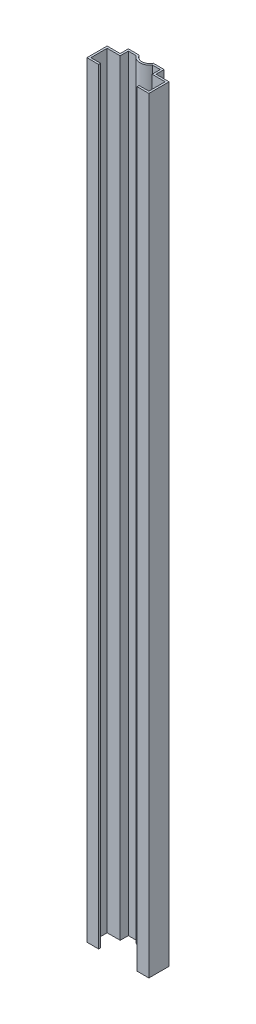
ISO-10303-21;
HEADER;
FILE_DESCRIPTION(('STEP AP214'),'2;1');
FILE_NAME('part.step','',(''),(''),'','','');
FILE_SCHEMA(('AUTOMOTIVE_DESIGN { 1 0 10303 214 1 1 1 1 }'));
ENDSEC;
DATA;
#1=APPLICATION_CONTEXT('core data for automotive mechanical design processes');
#2=APPLICATION_PROTOCOL_DEFINITION('international standard','automotive_design',2000,#1);
#3=PRODUCT_CONTEXT('',#1,'mechanical');
#4=PRODUCT('Part','Part','',(#3));
#5=PRODUCT_RELATED_PRODUCT_CATEGORY('part','',(#4));
#6=PRODUCT_DEFINITION_FORMATION('','',#4);
#7=PRODUCT_DEFINITION_CONTEXT('part definition',#1,'design');
#8=PRODUCT_DEFINITION('design','',#6,#7);
#9=PRODUCT_DEFINITION_SHAPE('','',#8);
#10=(LENGTH_UNIT() NAMED_UNIT(*) SI_UNIT(.MILLI.,.METRE.));
#11=(NAMED_UNIT(*) PLANE_ANGLE_UNIT() SI_UNIT($,.RADIAN.));
#12=(NAMED_UNIT(*) SI_UNIT($,.STERADIAN.) SOLID_ANGLE_UNIT());
#13=UNCERTAINTY_MEASURE_WITH_UNIT(LENGTH_MEASURE(1.E-05),#10,'distance_accuracy_value','');
#14=(GEOMETRIC_REPRESENTATION_CONTEXT(3) GLOBAL_UNCERTAINTY_ASSIGNED_CONTEXT((#13)) GLOBAL_UNIT_ASSIGNED_CONTEXT((#10,
#11,#12)) REPRESENTATION_CONTEXT('',''));
#15=CARTESIAN_POINT('',(0.,0.,0.));
#16=DIRECTION('',(0.,0.,1.));
#17=DIRECTION('',(1.,0.,0.));
#18=AXIS2_PLACEMENT_3D('',#15,#16,#17);
#19=CARTESIAN_POINT('',(0.,4.44089209850063E-13,-91.583123951777));
#20=DIRECTION('',(0.,1.,0.));
#21=DIRECTION('',(0.,0.,1.));
#22=AXIS2_PLACEMENT_3D('',#19,#20,#21);
#23=CYLINDRICAL_SURFACE('',#22,30.);
#24=CARTESIAN_POINT('',(0.,2350.,-91.583123951777));
#25=DIRECTION('',(0.,1.,0.));
#26=DIRECTION('',(0.,0.,1.));
#27=AXIS2_PLACEMENT_3D('',#24,#25,#26);
#28=CIRCLE('',#27,30.);
#29=CARTESIAN_POINT('',(-25.,2350.,-75.));
#30=VERTEX_POINT('',#29);
#31=CARTESIAN_POINT('',(25.,2350.,-75.));
#32=VERTEX_POINT('',#31);
#33=EDGE_CURVE('E225',#30,#32,#28,.T.);
#34=ORIENTED_EDGE('',*,*,#33,.F.);
#35=DIRECTION('',(0.,1.,0.));
#36=VECTOR('',#35,1.);
#37=CARTESIAN_POINT('',(-25.,4.44089209850063E-13,-75.));
#38=LINE('',#37,#36);
#39=CARTESIAN_POINT('',(-25.,4.44089209850063E-13,-75.));
#40=VERTEX_POINT('',#39);
#41=EDGE_CURVE('E11',#40,#30,#38,.T.);
#42=ORIENTED_EDGE('',*,*,#41,.F.);
#43=CARTESIAN_POINT('',(0.,4.44089209850063E-13,-91.583123951777));
#44=DIRECTION('',(0.,1.,0.));
#45=DIRECTION('',(0.,0.,1.));
#46=AXIS2_PLACEMENT_3D('',#43,#44,#45);
#47=CIRCLE('',#46,30.);
#48=CARTESIAN_POINT('',(25.,4.44089209850063E-13,-75.));
#49=VERTEX_POINT('',#48);
#50=EDGE_CURVE('E293',#40,#49,#47,.T.);
#51=ORIENTED_EDGE('',*,*,#50,.T.);
#52=DIRECTION('',(0.,1.,0.));
#53=VECTOR('',#52,1.);
#54=CARTESIAN_POINT('',(25.,4.44089209850063E-13,-75.));
#55=LINE('',#54,#53);
#56=EDGE_CURVE('E35',#49,#32,#55,.T.);
#57=ORIENTED_EDGE('',*,*,#56,.T.);
#58=EDGE_LOOP('',(#34,#42,#51,#57));
#59=FACE_BOUND('',#58,.T.);
#60=ADVANCED_FACE('F32',(#59),#23,.T.);
#61=CARTESIAN_POINT('',(-49.,4.44089209850063E-13,-75.));
#62=DIRECTION('',(0.,0.,1.));
#63=DIRECTION('',(1.,0.,0.));
#64=AXIS2_PLACEMENT_3D('',#61,#62,#63);
#65=PLANE('',#64);
#66=DIRECTION('',(1.,0.,0.));
#67=VECTOR('',#66,1.);
#68=CARTESIAN_POINT('',(-49.,2350.,-75.));
#69=LINE('',#68,#67);
#70=CARTESIAN_POINT('',(-49.,2350.,-75.));
#71=VERTEX_POINT('',#70);
#72=EDGE_CURVE('E291',#71,#30,#69,.T.);
#73=ORIENTED_EDGE('',*,*,#72,.F.);
#74=DIRECTION('',(0.,1.,0.));
#75=VECTOR('',#74,1.);
#76=CARTESIAN_POINT('',(-49.,4.44089209850063E-13,-75.));
#77=LINE('',#76,#75);
#78=CARTESIAN_POINT('',(-49.,4.44089209850063E-13,-75.));
#79=VERTEX_POINT('',#78);
#80=EDGE_CURVE('E41',#79,#71,#77,.T.);
#81=ORIENTED_EDGE('',*,*,#80,.F.);
#82=DIRECTION('',(1.,0.,0.));
#83=VECTOR('',#82,1.);
#84=CARTESIAN_POINT('',(-49.,4.44089209850063E-13,-75.));
#85=LINE('',#84,#83);
#86=EDGE_CURVE('E215',#79,#40,#85,.T.);
#87=ORIENTED_EDGE('',*,*,#86,.T.);
#88=ORIENTED_EDGE('',*,*,#41,.T.);
#89=EDGE_LOOP('',(#73,#81,#87,#88));
#90=FACE_BOUND('',#89,.T.);
#91=ADVANCED_FACE('F337',(#90),#65,.T.);
#92=CARTESIAN_POINT('',(-49.,4.44089209850063E-13,-50.));
#93=DIRECTION('',(1.,0.,0.));
#94=DIRECTION('',(0.,0.,-1.));
#95=AXIS2_PLACEMENT_3D('',#92,#93,#94);
#96=PLANE('',#95);
#97=DIRECTION('',(0.,0.,-1.));
#98=VECTOR('',#97,1.);
#99=CARTESIAN_POINT('',(-49.,2350.,-50.));
#100=LINE('',#99,#98);
#101=CARTESIAN_POINT('',(-49.,2350.,-50.));
#102=VERTEX_POINT('',#101);
#103=EDGE_CURVE('E202',#102,#71,#100,.T.);
#104=ORIENTED_EDGE('',*,*,#103,.F.);
#105=DIRECTION('',(0.,1.,0.));
#106=VECTOR('',#105,1.);
#107=CARTESIAN_POINT('',(-49.,4.44089209850063E-13,-50.));
#108=LINE('',#107,#106);
#109=CARTESIAN_POINT('',(-49.,4.44089209850063E-13,-50.));
#110=VERTEX_POINT('',#109);
#111=EDGE_CURVE('E197',#110,#102,#108,.T.);
#112=ORIENTED_EDGE('',*,*,#111,.F.);
#113=DIRECTION('',(0.,0.,-1.));
#114=VECTOR('',#113,1.);
#115=CARTESIAN_POINT('',(-49.,4.44089209850063E-13,-50.));
#116=LINE('',#115,#114);
#117=EDGE_CURVE('E200',#110,#79,#116,.T.);
#118=ORIENTED_EDGE('',*,*,#117,.T.);
#119=ORIENTED_EDGE('',*,*,#80,.T.);
#120=EDGE_LOOP('',(#104,#112,#118,#119));
#121=FACE_BOUND('',#120,.T.);
#122=ADVANCED_FACE('F199',(#121),#96,.T.);
#123=CARTESIAN_POINT('',(-89.,4.44089209850063E-13,-50.));
#124=DIRECTION('',(0.,0.,1.));
#125=DIRECTION('',(1.,0.,0.));
#126=AXIS2_PLACEMENT_3D('',#123,#124,#125);
#127=PLANE('',#126);
#128=DIRECTION('',(1.,0.,0.));
#129=VECTOR('',#128,1.);
#130=CARTESIAN_POINT('',(-89.,2350.,-50.));
#131=LINE('',#130,#129);
#132=CARTESIAN_POINT('',(-89.,2350.,-50.));
#133=VERTEX_POINT('',#132);
#134=EDGE_CURVE('E288',#133,#102,#131,.T.);
#135=ORIENTED_EDGE('',*,*,#134,.F.);
#136=DIRECTION('',(0.,1.,0.));
#137=VECTOR('',#136,1.);
#138=CARTESIAN_POINT('',(-89.,4.44089209850063E-13,-50.));
#139=LINE('',#138,#137);
#140=CARTESIAN_POINT('',(-89.,4.44089209850063E-13,-50.));
#141=VERTEX_POINT('',#140);
#142=EDGE_CURVE('E207',#141,#133,#139,.T.);
#143=ORIENTED_EDGE('',*,*,#142,.F.);
#144=DIRECTION('',(1.,0.,0.));
#145=VECTOR('',#144,1.);
#146=CARTESIAN_POINT('',(-89.,4.44089209850063E-13,-50.));
#147=LINE('',#146,#145);
#148=EDGE_CURVE('E213',#141,#110,#147,.T.);
#149=ORIENTED_EDGE('',*,*,#148,.T.);
#150=ORIENTED_EDGE('',*,*,#111,.T.);
#151=EDGE_LOOP('',(#135,#143,#149,#150));
#152=FACE_BOUND('',#151,.T.);
#153=ADVANCED_FACE('F217',(#152),#127,.T.);
#154=CARTESIAN_POINT('',(-89.,4.44089209850063E-13,0.));
#155=DIRECTION('',(1.,0.,0.));
#156=DIRECTION('',(0.,0.,-1.));
#157=AXIS2_PLACEMENT_3D('',#154,#155,#156);
#158=PLANE('',#157);
#159=DIRECTION('',(0.,0.,-1.));
#160=VECTOR('',#159,1.);
#161=CARTESIAN_POINT('',(-89.,2350.,0.));
#162=LINE('',#161,#160);
#163=CARTESIAN_POINT('',(-89.,2350.,0.));
#164=VERTEX_POINT('',#163);
#165=EDGE_CURVE('E285',#164,#133,#162,.T.);
#166=ORIENTED_EDGE('',*,*,#165,.F.);
#167=DIRECTION('',(0.,1.,0.));
#168=VECTOR('',#167,1.);
#169=CARTESIAN_POINT('',(-89.,4.44089209850063E-13,0.));
#170=LINE('',#169,#168);
#171=CARTESIAN_POINT('',(-89.,4.44089209850063E-13,0.));
#172=VERTEX_POINT('',#171);
#173=EDGE_CURVE('E297',#172,#164,#170,.T.);
#174=ORIENTED_EDGE('',*,*,#173,.F.);
#175=DIRECTION('',(0.,0.,-1.));
#176=VECTOR('',#175,1.);
#177=CARTESIAN_POINT('',(-89.,4.44089209850063E-13,0.));
#178=LINE('',#177,#176);
#179=EDGE_CURVE('E218',#172,#141,#178,.T.);
#180=ORIENTED_EDGE('',*,*,#179,.T.);
#181=ORIENTED_EDGE('',*,*,#142,.T.);
#182=EDGE_LOOP('',(#166,#174,#180,#181));
#183=FACE_BOUND('',#182,.T.);
#184=ADVANCED_FACE('F350',(#183),#158,.T.);
#185=CARTESIAN_POINT('',(-59.,4.44089209850063E-13,0.));
#186=DIRECTION('',(0.,0.,-1.));
#187=DIRECTION('',(-1.,0.,0.));
#188=AXIS2_PLACEMENT_3D('',#185,#186,#187);
#189=PLANE('',#188);
#190=DIRECTION('',(-1.,0.,0.));
#191=VECTOR('',#190,1.);
#192=CARTESIAN_POINT('',(-59.,2350.,0.));
#193=LINE('',#192,#191);
#194=CARTESIAN_POINT('',(-59.,2350.,0.));
#195=VERTEX_POINT('',#194);
#196=EDGE_CURVE('E282',#195,#164,#193,.T.);
#197=ORIENTED_EDGE('',*,*,#196,.F.);
#198=DIRECTION('',(0.,1.,0.));
#199=VECTOR('',#198,1.);
#200=CARTESIAN_POINT('',(-59.,4.44089209850063E-13,0.));
#201=LINE('',#200,#199);
#202=CARTESIAN_POINT('',(-59.,4.44089209850063E-13,0.));
#203=VERTEX_POINT('',#202);
#204=EDGE_CURVE('E299',#203,#195,#201,.T.);
#205=ORIENTED_EDGE('',*,*,#204,.F.);
#206=DIRECTION('',(-1.,0.,0.));
#207=VECTOR('',#206,1.);
#208=CARTESIAN_POINT('',(-59.,4.44089209850063E-13,0.));
#209=LINE('',#208,#207);
#210=EDGE_CURVE('E220',#203,#172,#209,.T.);
#211=ORIENTED_EDGE('',*,*,#210,.T.);
#212=ORIENTED_EDGE('',*,*,#173,.T.);
#213=EDGE_LOOP('',(#197,#205,#211,#212));
#214=FACE_BOUND('',#213,.T.);
#215=ADVANCED_FACE('F353',(#214),#189,.T.);
#216=CARTESIAN_POINT('',(-59.,4.44089209850063E-13,6.));
#217=DIRECTION('',(1.,0.,0.));
#218=DIRECTION('',(0.,0.,-1.));
#219=AXIS2_PLACEMENT_3D('',#216,#217,#218);
#220=PLANE('',#219);
#221=DIRECTION('',(0.,0.,-1.));
#222=VECTOR('',#221,1.);
#223=CARTESIAN_POINT('',(-59.,2350.,6.));
#224=LINE('',#223,#222);
#225=CARTESIAN_POINT('',(-59.,2350.,6.));
#226=VERTEX_POINT('',#225);
#227=EDGE_CURVE('E279',#226,#195,#224,.T.);
#228=ORIENTED_EDGE('',*,*,#227,.F.);
#229=DIRECTION('',(0.,1.,0.));
#230=VECTOR('',#229,1.);
#231=CARTESIAN_POINT('',(-59.,4.44089209850063E-13,6.));
#232=LINE('',#231,#230);
#233=CARTESIAN_POINT('',(-59.,4.44089209850063E-13,6.));
#234=VERTEX_POINT('',#233);
#235=EDGE_CURVE('E301',#234,#226,#232,.T.);
#236=ORIENTED_EDGE('',*,*,#235,.F.);
#237=DIRECTION('',(0.,0.,-1.));
#238=VECTOR('',#237,1.);
#239=CARTESIAN_POINT('',(-59.,4.44089209850063E-13,6.));
#240=LINE('',#239,#238);
#241=EDGE_CURVE('E643',#234,#203,#240,.T.);
#242=ORIENTED_EDGE('',*,*,#241,.T.);
#243=ORIENTED_EDGE('',*,*,#204,.T.);
#244=EDGE_LOOP('',(#228,#236,#242,#243));
#245=FACE_BOUND('',#244,.T.);
#246=ADVANCED_FACE('F357',(#245),#220,.T.);
#247=CARTESIAN_POINT('',(-95.,4.44089209850063E-13,6.));
#248=DIRECTION('',(0.,0.,1.));
#249=DIRECTION('',(1.,0.,0.));
#250=AXIS2_PLACEMENT_3D('',#247,#248,#249);
#251=PLANE('',#250);
#252=DIRECTION('',(1.,0.,0.));
#253=VECTOR('',#252,1.);
#254=CARTESIAN_POINT('',(-95.,2350.,6.));
#255=LINE('',#254,#253);
#256=CARTESIAN_POINT('',(-95.,2350.,6.));
#257=VERTEX_POINT('',#256);
#258=EDGE_CURVE('E276',#257,#226,#255,.T.);
#259=ORIENTED_EDGE('',*,*,#258,.F.);
#260=DIRECTION('',(0.,1.,0.));
#261=VECTOR('',#260,1.);
#262=CARTESIAN_POINT('',(-95.,4.44089209850063E-13,6.));
#263=LINE('',#262,#261);
#264=CARTESIAN_POINT('',(-95.,4.44089209850063E-13,6.));
#265=VERTEX_POINT('',#264);
#266=EDGE_CURVE('E303',#265,#257,#263,.T.);
#267=ORIENTED_EDGE('',*,*,#266,.F.);
#268=DIRECTION('',(1.,0.,0.));
#269=VECTOR('',#268,1.);
#270=CARTESIAN_POINT('',(-95.,4.44089209850063E-13,6.));
#271=LINE('',#270,#269);
#272=EDGE_CURVE('E647',#265,#234,#271,.T.);
#273=ORIENTED_EDGE('',*,*,#272,.T.);
#274=ORIENTED_EDGE('',*,*,#235,.T.);
#275=EDGE_LOOP('',(#259,#267,#273,#274));
#276=FACE_BOUND('',#275,.T.);
#277=ADVANCED_FACE('F361',(#276),#251,.T.);
#278=CARTESIAN_POINT('',(-95.,4.44089209850063E-13,-56.));
#279=DIRECTION('',(-1.,0.,0.));
#280=DIRECTION('',(0.,0.,1.));
#281=AXIS2_PLACEMENT_3D('',#278,#279,#280);
#282=PLANE('',#281);
#283=DIRECTION('',(0.,0.,1.));
#284=VECTOR('',#283,1.);
#285=CARTESIAN_POINT('',(-95.,2350.,-56.));
#286=LINE('',#285,#284);
#287=CARTESIAN_POINT('',(-95.,2350.,-56.));
#288=VERTEX_POINT('',#287);
#289=EDGE_CURVE('E273',#288,#257,#286,.T.);
#290=ORIENTED_EDGE('',*,*,#289,.F.);
#291=DIRECTION('',(0.,1.,0.));
#292=VECTOR('',#291,1.);
#293=CARTESIAN_POINT('',(-95.,4.44089209850063E-13,-56.));
#294=LINE('',#293,#292);
#295=CARTESIAN_POINT('',(-95.,4.44089209850063E-13,-56.));
#296=VERTEX_POINT('',#295);
#297=EDGE_CURVE('E305',#296,#288,#294,.T.);
#298=ORIENTED_EDGE('',*,*,#297,.F.);
#299=DIRECTION('',(0.,0.,1.));
#300=VECTOR('',#299,1.);
#301=CARTESIAN_POINT('',(-95.,4.44089209850063E-13,-56.));
#302=LINE('',#301,#300);
#303=EDGE_CURVE('E636',#296,#265,#302,.T.);
#304=ORIENTED_EDGE('',*,*,#303,.T.);
#305=ORIENTED_EDGE('',*,*,#266,.T.);
#306=EDGE_LOOP('',(#290,#298,#304,#305));
#307=FACE_BOUND('',#306,.T.);
#308=ADVANCED_FACE('F365',(#307),#282,.T.);
#309=CARTESIAN_POINT('',(-55.,4.44089209850063E-13,-56.));
#310=DIRECTION('',(0.,0.,-1.));
#311=DIRECTION('',(-1.,0.,0.));
#312=AXIS2_PLACEMENT_3D('',#309,#310,#311);
#313=PLANE('',#312);
#314=DIRECTION('',(-1.,0.,0.));
#315=VECTOR('',#314,1.);
#316=CARTESIAN_POINT('',(-55.,2350.,-56.));
#317=LINE('',#316,#315);
#318=CARTESIAN_POINT('',(-55.,2350.,-56.));
#319=VERTEX_POINT('',#318);
#320=EDGE_CURVE('E270',#319,#288,#317,.T.);
#321=ORIENTED_EDGE('',*,*,#320,.F.);
#322=DIRECTION('',(0.,1.,0.));
#323=VECTOR('',#322,1.);
#324=CARTESIAN_POINT('',(-55.,4.44089209850063E-13,-56.));
#325=LINE('',#324,#323);
#326=CARTESIAN_POINT('',(-55.,4.44089209850063E-13,-56.));
#327=VERTEX_POINT('',#326);
#328=EDGE_CURVE('E307',#327,#319,#325,.T.);
#329=ORIENTED_EDGE('',*,*,#328,.F.);
#330=DIRECTION('',(-1.,0.,0.));
#331=VECTOR('',#330,1.);
#332=CARTESIAN_POINT('',(-55.,4.44089209850063E-13,-56.));
#333=LINE('',#332,#331);
#334=EDGE_CURVE('E632',#327,#296,#333,.T.);
#335=ORIENTED_EDGE('',*,*,#334,.T.);
#336=ORIENTED_EDGE('',*,*,#297,.T.);
#337=EDGE_LOOP('',(#321,#329,#335,#336));
#338=FACE_BOUND('',#337,.T.);
#339=ADVANCED_FACE('F369',(#338),#313,.T.);
#340=CARTESIAN_POINT('',(-55.,4.44089209850063E-13,-81.));
#341=DIRECTION('',(-1.,0.,0.));
#342=DIRECTION('',(0.,0.,1.));
#343=AXIS2_PLACEMENT_3D('',#340,#341,#342);
#344=PLANE('',#343);
#345=DIRECTION('',(0.,0.,1.));
#346=VECTOR('',#345,1.);
#347=CARTESIAN_POINT('',(-55.,2350.,-81.));
#348=LINE('',#347,#346);
#349=CARTESIAN_POINT('',(-55.,2350.,-81.));
#350=VERTEX_POINT('',#349);
#351=EDGE_CURVE('E267',#350,#319,#348,.T.);
#352=ORIENTED_EDGE('',*,*,#351,.F.);
#353=DIRECTION('',(0.,1.,0.));
#354=VECTOR('',#353,1.);
#355=CARTESIAN_POINT('',(-55.,4.44089209850063E-13,-81.));
#356=LINE('',#355,#354);
#357=CARTESIAN_POINT('',(-55.,4.44089209850063E-13,-81.));
#358=VERTEX_POINT('',#357);
#359=EDGE_CURVE('E309',#358,#350,#356,.T.);
#360=ORIENTED_EDGE('',*,*,#359,.F.);
#361=DIRECTION('',(0.,0.,1.));
#362=VECTOR('',#361,1.);
#363=CARTESIAN_POINT('',(-55.,4.44089209850063E-13,-81.));
#364=LINE('',#363,#362);
#365=EDGE_CURVE('E653',#358,#327,#364,.T.);
#366=ORIENTED_EDGE('',*,*,#365,.T.);
#367=ORIENTED_EDGE('',*,*,#328,.T.);
#368=EDGE_LOOP('',(#352,#360,#366,#367));
#369=FACE_BOUND('',#368,.T.);
#370=ADVANCED_FACE('F373',(#369),#344,.T.);
#371=CARTESIAN_POINT('',(-21.5406009066907,4.44089209850063E-13,-81.));
#372=DIRECTION('',(0.,0.,-1.));
#373=DIRECTION('',(-1.,0.,0.));
#374=AXIS2_PLACEMENT_3D('',#371,#372,#373);
#375=PLANE('',#374);
#376=DIRECTION('',(-1.,0.,0.));
#377=VECTOR('',#376,1.);
#378=CARTESIAN_POINT('',(-21.5406009066907,2350.,-81.));
#379=LINE('',#378,#377);
#380=CARTESIAN_POINT('',(-21.5406009066907,2350.,-81.));
#381=VERTEX_POINT('',#380);
#382=EDGE_CURVE('E264',#381,#350,#379,.T.);
#383=ORIENTED_EDGE('',*,*,#382,.F.);
#384=DIRECTION('',(0.,1.,0.));
#385=VECTOR('',#384,1.);
#386=CARTESIAN_POINT('',(-21.5406009066907,4.44089209850063E-13,-81.));
#387=LINE('',#386,#385);
#388=CARTESIAN_POINT('',(-21.5406009066907,4.44089209850063E-13,-81.));
#389=VERTEX_POINT('',#388);
#390=EDGE_CURVE('E311',#389,#381,#387,.T.);
#391=ORIENTED_EDGE('',*,*,#390,.F.);
#392=DIRECTION('',(-1.,0.,0.));
#393=VECTOR('',#392,1.);
#394=CARTESIAN_POINT('',(-21.5406009066907,4.44089209850063E-13,-81.));
#395=LINE('',#394,#393);
#396=EDGE_CURVE('E625',#389,#358,#395,.T.);
#397=ORIENTED_EDGE('',*,*,#396,.T.);
#398=ORIENTED_EDGE('',*,*,#359,.T.);
#399=EDGE_LOOP('',(#383,#391,#397,#398));
#400=FACE_BOUND('',#399,.T.);
#401=ADVANCED_FACE('F377',(#400),#375,.T.);
#402=CARTESIAN_POINT('',(0.,4.44089209850063E-13,-91.583123951777));
#403=DIRECTION('',(0.,1.,0.));
#404=DIRECTION('',(0.,0.,1.));
#405=AXIS2_PLACEMENT_3D('',#402,#403,#404);
#406=CYLINDRICAL_SURFACE('',#405,24.);
#407=CARTESIAN_POINT('',(0.,2350.,-91.583123951777));
#408=DIRECTION('',(0.,-1.,0.));
#409=DIRECTION('',(0.,0.,-1.));
#410=AXIS2_PLACEMENT_3D('',#407,#408,#409);
#411=CIRCLE('',#410,24.);
#412=CARTESIAN_POINT('',(21.5406009066907,2350.,-81.));
#413=VERTEX_POINT('',#412);
#414=EDGE_CURVE('E261',#413,#381,#411,.T.);
#415=ORIENTED_EDGE('',*,*,#414,.F.);
#416=DIRECTION('',(0.,1.,0.));
#417=VECTOR('',#416,1.);
#418=CARTESIAN_POINT('',(21.5406009066907,4.44089209850063E-13,-81.));
#419=LINE('',#418,#417);
#420=CARTESIAN_POINT('',(21.5406009066907,4.44089209850063E-13,-81.));
#421=VERTEX_POINT('',#420);
#422=EDGE_CURVE('E313',#421,#413,#419,.T.);
#423=ORIENTED_EDGE('',*,*,#422,.F.);
#424=CARTESIAN_POINT('',(0.,4.44089209850063E-13,-91.583123951777));
#425=DIRECTION('',(0.,-1.,0.));
#426=DIRECTION('',(0.,0.,-1.));
#427=AXIS2_PLACEMENT_3D('',#424,#425,#426);
#428=CIRCLE('',#427,24.);
#429=EDGE_CURVE('E621',#421,#389,#428,.T.);
#430=ORIENTED_EDGE('',*,*,#429,.T.);
#431=ORIENTED_EDGE('',*,*,#390,.T.);
#432=EDGE_LOOP('',(#415,#423,#430,#431));
#433=FACE_BOUND('',#432,.T.);
#434=ADVANCED_FACE('F381',(#433),#406,.F.);
#435=CARTESIAN_POINT('',(55.,4.44089209850063E-13,-81.));
#436=DIRECTION('',(0.,0.,-1.));
#437=DIRECTION('',(-1.,0.,0.));
#438=AXIS2_PLACEMENT_3D('',#435,#436,#437);
#439=PLANE('',#438);
#440=DIRECTION('',(-1.,0.,0.));
#441=VECTOR('',#440,1.);
#442=CARTESIAN_POINT('',(55.,2350.,-81.));
#443=LINE('',#442,#441);
#444=CARTESIAN_POINT('',(55.,2350.,-81.));
#445=VERTEX_POINT('',#444);
#446=EDGE_CURVE('E258',#445,#413,#443,.T.);
#447=ORIENTED_EDGE('',*,*,#446,.F.);
#448=DIRECTION('',(0.,1.,0.));
#449=VECTOR('',#448,1.);
#450=CARTESIAN_POINT('',(55.,4.44089209850063E-13,-81.));
#451=LINE('',#450,#449);
#452=CARTESIAN_POINT('',(55.,4.44089209850063E-13,-81.));
#453=VERTEX_POINT('',#452);
#454=EDGE_CURVE('E315',#453,#445,#451,.T.);
#455=ORIENTED_EDGE('',*,*,#454,.F.);
#456=DIRECTION('',(-1.,0.,0.));
#457=VECTOR('',#456,1.);
#458=CARTESIAN_POINT('',(55.,4.44089209850063E-13,-81.));
#459=LINE('',#458,#457);
#460=EDGE_CURVE('E657',#453,#421,#459,.T.);
#461=ORIENTED_EDGE('',*,*,#460,.T.);
#462=ORIENTED_EDGE('',*,*,#422,.T.);
#463=EDGE_LOOP('',(#447,#455,#461,#462));
#464=FACE_BOUND('',#463,.T.);
#465=ADVANCED_FACE('F385',(#464),#439,.T.);
#466=CARTESIAN_POINT('',(55.,4.44089209850063E-13,-56.));
#467=DIRECTION('',(1.,0.,0.));
#468=DIRECTION('',(0.,0.,-1.));
#469=AXIS2_PLACEMENT_3D('',#466,#467,#468);
#470=PLANE('',#469);
#471=DIRECTION('',(0.,0.,-1.));
#472=VECTOR('',#471,1.);
#473=CARTESIAN_POINT('',(55.,2350.,-56.));
#474=LINE('',#473,#472);
#475=CARTESIAN_POINT('',(55.,2350.,-56.));
#476=VERTEX_POINT('',#475);
#477=EDGE_CURVE('E255',#476,#445,#474,.T.);
#478=ORIENTED_EDGE('',*,*,#477,.F.);
#479=DIRECTION('',(0.,1.,0.));
#480=VECTOR('',#479,1.);
#481=CARTESIAN_POINT('',(55.,4.44089209850063E-13,-56.));
#482=LINE('',#481,#480);
#483=CARTESIAN_POINT('',(55.,4.44089209850063E-13,-56.));
#484=VERTEX_POINT('',#483);
#485=EDGE_CURVE('E317',#484,#476,#482,.T.);
#486=ORIENTED_EDGE('',*,*,#485,.F.);
#487=DIRECTION('',(0.,0.,-1.));
#488=VECTOR('',#487,1.);
#489=CARTESIAN_POINT('',(55.,4.44089209850063E-13,-56.));
#490=LINE('',#489,#488);
#491=EDGE_CURVE('E614',#484,#453,#490,.T.);
#492=ORIENTED_EDGE('',*,*,#491,.T.);
#493=ORIENTED_EDGE('',*,*,#454,.T.);
#494=EDGE_LOOP('',(#478,#486,#492,#493));
#495=FACE_BOUND('',#494,.T.);
#496=ADVANCED_FACE('F389',(#495),#470,.T.);
#497=CARTESIAN_POINT('',(95.,4.44089209850063E-13,-56.));
#498=DIRECTION('',(0.,0.,-1.));
#499=DIRECTION('',(-1.,0.,0.));
#500=AXIS2_PLACEMENT_3D('',#497,#498,#499);
#501=PLANE('',#500);
#502=DIRECTION('',(-1.,0.,0.));
#503=VECTOR('',#502,1.);
#504=CARTESIAN_POINT('',(95.,2350.,-56.));
#505=LINE('',#504,#503);
#506=CARTESIAN_POINT('',(95.,2350.,-56.));
#507=VERTEX_POINT('',#506);
#508=EDGE_CURVE('E252',#507,#476,#505,.T.);
#509=ORIENTED_EDGE('',*,*,#508,.F.);
#510=DIRECTION('',(0.,1.,0.));
#511=VECTOR('',#510,1.);
#512=CARTESIAN_POINT('',(95.,4.44089209850063E-13,-56.));
#513=LINE('',#512,#511);
#514=CARTESIAN_POINT('',(95.,4.44089209850063E-13,-56.));
#515=VERTEX_POINT('',#514);
#516=EDGE_CURVE('E319',#515,#507,#513,.T.);
#517=ORIENTED_EDGE('',*,*,#516,.F.);
#518=DIRECTION('',(-1.,0.,0.));
#519=VECTOR('',#518,1.);
#520=CARTESIAN_POINT('',(95.,4.44089209850063E-13,-56.));
#521=LINE('',#520,#519);
#522=EDGE_CURVE('E610',#515,#484,#521,.T.);
#523=ORIENTED_EDGE('',*,*,#522,.T.);
#524=ORIENTED_EDGE('',*,*,#485,.T.);
#525=EDGE_LOOP('',(#509,#517,#523,#524));
#526=FACE_BOUND('',#525,.T.);
#527=ADVANCED_FACE('F393',(#526),#501,.T.);
#528=CARTESIAN_POINT('',(95.,4.44089209850063E-13,6.));
#529=DIRECTION('',(1.,0.,0.));
#530=DIRECTION('',(0.,0.,-1.));
#531=AXIS2_PLACEMENT_3D('',#528,#529,#530);
#532=PLANE('',#531);
#533=DIRECTION('',(0.,0.,-1.));
#534=VECTOR('',#533,1.);
#535=CARTESIAN_POINT('',(95.,2350.,6.));
#536=LINE('',#535,#534);
#537=CARTESIAN_POINT('',(95.,2350.,6.));
#538=VERTEX_POINT('',#537);
#539=EDGE_CURVE('E249',#538,#507,#536,.T.);
#540=ORIENTED_EDGE('',*,*,#539,.F.);
#541=DIRECTION('',(0.,1.,0.));
#542=VECTOR('',#541,1.);
#543=CARTESIAN_POINT('',(95.,4.44089209850063E-13,6.));
#544=LINE('',#543,#542);
#545=CARTESIAN_POINT('',(95.,4.44089209850063E-13,6.));
#546=VERTEX_POINT('',#545);
#547=EDGE_CURVE('E321',#546,#538,#544,.T.);
#548=ORIENTED_EDGE('',*,*,#547,.F.);
#549=DIRECTION('',(0.,0.,-1.));
#550=VECTOR('',#549,1.);
#551=CARTESIAN_POINT('',(95.,4.44089209850063E-13,6.));
#552=LINE('',#551,#550);
#553=EDGE_CURVE('E661',#546,#515,#552,.T.);
#554=ORIENTED_EDGE('',*,*,#553,.T.);
#555=ORIENTED_EDGE('',*,*,#516,.T.);
#556=EDGE_LOOP('',(#540,#548,#554,#555));
#557=FACE_BOUND('',#556,.T.);
#558=ADVANCED_FACE('F397',(#557),#532,.T.);
#559=CARTESIAN_POINT('',(59.,4.44089209850063E-13,6.));
#560=DIRECTION('',(0.,0.,1.));
#561=DIRECTION('',(1.,0.,0.));
#562=AXIS2_PLACEMENT_3D('',#559,#560,#561);
#563=PLANE('',#562);
#564=DIRECTION('',(1.,0.,0.));
#565=VECTOR('',#564,1.);
#566=CARTESIAN_POINT('',(59.,2350.,6.));
#567=LINE('',#566,#565);
#568=CARTESIAN_POINT('',(59.,2350.,6.));
#569=VERTEX_POINT('',#568);
#570=EDGE_CURVE('E246',#569,#538,#567,.T.);
#571=ORIENTED_EDGE('',*,*,#570,.F.);
#572=DIRECTION('',(0.,1.,0.));
#573=VECTOR('',#572,1.);
#574=CARTESIAN_POINT('',(59.,4.44089209850063E-13,6.));
#575=LINE('',#574,#573);
#576=CARTESIAN_POINT('',(59.,4.44089209850063E-13,6.));
#577=VERTEX_POINT('',#576);
#578=EDGE_CURVE('E323',#577,#569,#575,.T.);
#579=ORIENTED_EDGE('',*,*,#578,.F.);
#580=DIRECTION('',(1.,0.,0.));
#581=VECTOR('',#580,1.);
#582=CARTESIAN_POINT('',(59.,4.44089209850063E-13,6.));
#583=LINE('',#582,#581);
#584=EDGE_CURVE('E603',#577,#546,#583,.T.);
#585=ORIENTED_EDGE('',*,*,#584,.T.);
#586=ORIENTED_EDGE('',*,*,#547,.T.);
#587=EDGE_LOOP('',(#571,#579,#585,#586));
#588=FACE_BOUND('',#587,.T.);
#589=ADVANCED_FACE('F401',(#588),#563,.T.);
#590=CARTESIAN_POINT('',(59.,4.44089209850063E-13,0.));
#591=DIRECTION('',(-1.,0.,0.));
#592=DIRECTION('',(0.,0.,1.));
#593=AXIS2_PLACEMENT_3D('',#590,#591,#592);
#594=PLANE('',#593);
#595=DIRECTION('',(0.,0.,1.));
#596=VECTOR('',#595,1.);
#597=CARTESIAN_POINT('',(59.,2350.,0.));
#598=LINE('',#597,#596);
#599=CARTESIAN_POINT('',(59.,2350.,0.));
#600=VERTEX_POINT('',#599);
#601=EDGE_CURVE('E243',#600,#569,#598,.T.);
#602=ORIENTED_EDGE('',*,*,#601,.F.);
#603=DIRECTION('',(0.,1.,0.));
#604=VECTOR('',#603,1.);
#605=CARTESIAN_POINT('',(59.,4.44089209850063E-13,0.));
#606=LINE('',#605,#604);
#607=CARTESIAN_POINT('',(59.,4.44089209850063E-13,0.));
#608=VERTEX_POINT('',#607);
#609=EDGE_CURVE('E325',#608,#600,#606,.T.);
#610=ORIENTED_EDGE('',*,*,#609,.F.);
#611=DIRECTION('',(0.,0.,1.));
#612=VECTOR('',#611,1.);
#613=CARTESIAN_POINT('',(59.,4.44089209850063E-13,0.));
#614=LINE('',#613,#612);
#615=EDGE_CURVE('E599',#608,#577,#614,.T.);
#616=ORIENTED_EDGE('',*,*,#615,.T.);
#617=ORIENTED_EDGE('',*,*,#578,.T.);
#618=EDGE_LOOP('',(#602,#610,#616,#617));
#619=FACE_BOUND('',#618,.T.);
#620=ADVANCED_FACE('F405',(#619),#594,.T.);
#621=CARTESIAN_POINT('',(89.,4.44089209850063E-13,0.));
#622=DIRECTION('',(0.,0.,-1.));
#623=DIRECTION('',(-1.,0.,0.));
#624=AXIS2_PLACEMENT_3D('',#621,#622,#623);
#625=PLANE('',#624);
#626=DIRECTION('',(-1.,0.,0.));
#627=VECTOR('',#626,1.);
#628=CARTESIAN_POINT('',(89.,2350.,0.));
#629=LINE('',#628,#627);
#630=CARTESIAN_POINT('',(89.,2350.,0.));
#631=VERTEX_POINT('',#630);
#632=EDGE_CURVE('E240',#631,#600,#629,.T.);
#633=ORIENTED_EDGE('',*,*,#632,.F.);
#634=DIRECTION('',(0.,1.,0.));
#635=VECTOR('',#634,1.);
#636=CARTESIAN_POINT('',(89.,4.44089209850063E-13,0.));
#637=LINE('',#636,#635);
#638=CARTESIAN_POINT('',(89.,4.44089209850063E-13,0.));
#639=VERTEX_POINT('',#638);
#640=EDGE_CURVE('E327',#639,#631,#637,.T.);
#641=ORIENTED_EDGE('',*,*,#640,.F.);
#642=DIRECTION('',(-1.,0.,0.));
#643=VECTOR('',#642,1.);
#644=CARTESIAN_POINT('',(89.,4.44089209850063E-13,0.));
#645=LINE('',#644,#643);
#646=EDGE_CURVE('E665',#639,#608,#645,.T.);
#647=ORIENTED_EDGE('',*,*,#646,.T.);
#648=ORIENTED_EDGE('',*,*,#609,.T.);
#649=EDGE_LOOP('',(#633,#641,#647,#648));
#650=FACE_BOUND('',#649,.T.);
#651=ADVANCED_FACE('F409',(#650),#625,.T.);
#652=CARTESIAN_POINT('',(89.,4.44089209850063E-13,-50.));
#653=DIRECTION('',(-1.,0.,0.));
#654=DIRECTION('',(0.,0.,1.));
#655=AXIS2_PLACEMENT_3D('',#652,#653,#654);
#656=PLANE('',#655);
#657=DIRECTION('',(0.,0.,1.));
#658=VECTOR('',#657,1.);
#659=CARTESIAN_POINT('',(89.,2350.,-50.));
#660=LINE('',#659,#658);
#661=CARTESIAN_POINT('',(89.,2350.,-50.));
#662=VERTEX_POINT('',#661);
#663=EDGE_CURVE('E237',#662,#631,#660,.T.);
#664=ORIENTED_EDGE('',*,*,#663,.F.);
#665=DIRECTION('',(0.,1.,0.));
#666=VECTOR('',#665,1.);
#667=CARTESIAN_POINT('',(89.,4.44089209850063E-13,-50.));
#668=LINE('',#667,#666);
#669=CARTESIAN_POINT('',(89.,4.44089209850063E-13,-50.));
#670=VERTEX_POINT('',#669);
#671=EDGE_CURVE('E329',#670,#662,#668,.T.);
#672=ORIENTED_EDGE('',*,*,#671,.F.);
#673=DIRECTION('',(0.,0.,1.));
#674=VECTOR('',#673,1.);
#675=CARTESIAN_POINT('',(89.,4.44089209850063E-13,-50.));
#676=LINE('',#675,#674);
#677=EDGE_CURVE('E592',#670,#639,#676,.T.);
#678=ORIENTED_EDGE('',*,*,#677,.T.);
#679=ORIENTED_EDGE('',*,*,#640,.T.);
#680=EDGE_LOOP('',(#664,#672,#678,#679));
#681=FACE_BOUND('',#680,.T.);
#682=ADVANCED_FACE('F413',(#681),#656,.T.);
#683=CARTESIAN_POINT('',(49.,4.44089209850063E-13,-50.));
#684=DIRECTION('',(0.,0.,1.));
#685=DIRECTION('',(1.,0.,0.));
#686=AXIS2_PLACEMENT_3D('',#683,#684,#685);
#687=PLANE('',#686);
#688=DIRECTION('',(1.,0.,0.));
#689=VECTOR('',#688,1.);
#690=CARTESIAN_POINT('',(49.,2350.,-50.));
#691=LINE('',#690,#689);
#692=CARTESIAN_POINT('',(49.,2350.,-50.));
#693=VERTEX_POINT('',#692);
#694=EDGE_CURVE('E234',#693,#662,#691,.T.);
#695=ORIENTED_EDGE('',*,*,#694,.F.);
#696=DIRECTION('',(0.,1.,0.));
#697=VECTOR('',#696,1.);
#698=CARTESIAN_POINT('',(49.,4.44089209850063E-13,-50.));
#699=LINE('',#698,#697);
#700=CARTESIAN_POINT('',(49.,4.44089209850063E-13,-50.));
#701=VERTEX_POINT('',#700);
#702=EDGE_CURVE('E331',#701,#693,#699,.T.);
#703=ORIENTED_EDGE('',*,*,#702,.F.);
#704=DIRECTION('',(1.,0.,0.));
#705=VECTOR('',#704,1.);
#706=CARTESIAN_POINT('',(49.,4.44089209850063E-13,-50.));
#707=LINE('',#706,#705);
#708=EDGE_CURVE('E588',#701,#670,#707,.T.);
#709=ORIENTED_EDGE('',*,*,#708,.T.);
#710=ORIENTED_EDGE('',*,*,#671,.T.);
#711=EDGE_LOOP('',(#695,#703,#709,#710));
#712=FACE_BOUND('',#711,.T.);
#713=ADVANCED_FACE('F417',(#712),#687,.T.);
#714=CARTESIAN_POINT('',(49.,4.44089209850063E-13,-75.));
#715=DIRECTION('',(-1.,0.,0.));
#716=DIRECTION('',(0.,0.,1.));
#717=AXIS2_PLACEMENT_3D('',#714,#715,#716);
#718=PLANE('',#717);
#719=DIRECTION('',(0.,0.,1.));
#720=VECTOR('',#719,1.);
#721=CARTESIAN_POINT('',(49.,2350.,-75.));
#722=LINE('',#721,#720);
#723=CARTESIAN_POINT('',(49.,2350.,-75.));
#724=VERTEX_POINT('',#723);
#725=EDGE_CURVE('E231',#724,#693,#722,.T.);
#726=ORIENTED_EDGE('',*,*,#725,.F.);
#727=DIRECTION('',(0.,1.,0.));
#728=VECTOR('',#727,1.);
#729=CARTESIAN_POINT('',(49.,4.44089209850063E-13,-75.));
#730=LINE('',#729,#728);
#731=CARTESIAN_POINT('',(49.,4.44089209850063E-13,-75.));
#732=VERTEX_POINT('',#731);
#733=EDGE_CURVE('E332',#732,#724,#730,.T.);
#734=ORIENTED_EDGE('',*,*,#733,.F.);
#735=DIRECTION('',(0.,0.,1.));
#736=VECTOR('',#735,1.);
#737=CARTESIAN_POINT('',(49.,4.44089209850063E-13,-75.));
#738=LINE('',#737,#736);
#739=EDGE_CURVE('E669',#732,#701,#738,.T.);
#740=ORIENTED_EDGE('',*,*,#739,.T.);
#741=ORIENTED_EDGE('',*,*,#702,.T.);
#742=EDGE_LOOP('',(#726,#734,#740,#741));
#743=FACE_BOUND('',#742,.T.);
#744=ADVANCED_FACE('F421',(#743),#718,.T.);
#745=CARTESIAN_POINT('',(25.,4.44089209850063E-13,-75.));
#746=DIRECTION('',(0.,0.,1.));
#747=DIRECTION('',(1.,0.,0.));
#748=AXIS2_PLACEMENT_3D('',#745,#746,#747);
#749=PLANE('',#748);
#750=DIRECTION('',(1.,0.,0.));
#751=VECTOR('',#750,1.);
#752=CARTESIAN_POINT('',(25.,2350.,-75.));
#753=LINE('',#752,#751);
#754=EDGE_CURVE('E228',#32,#724,#753,.T.);
#755=ORIENTED_EDGE('',*,*,#754,.F.);
#756=ORIENTED_EDGE('',*,*,#56,.F.);
#757=DIRECTION('',(1.,0.,0.));
#758=VECTOR('',#757,1.);
#759=CARTESIAN_POINT('',(25.,4.44089209850063E-13,-75.));
#760=LINE('',#759,#758);
#761=EDGE_CURVE('E671',#49,#732,#760,.T.);
#762=ORIENTED_EDGE('',*,*,#761,.T.);
#763=ORIENTED_EDGE('',*,*,#733,.T.);
#764=EDGE_LOOP('',(#755,#756,#762,#763));
#765=FACE_BOUND('',#764,.T.);
#766=ADVANCED_FACE('F334',(#765),#749,.T.);
#767=CARTESIAN_POINT('',(0.,4.44089209850063E-13,-91.583123951777));
#768=DIRECTION('',(0.,1.,0.));
#769=DIRECTION('',(0.,0.,1.));
#770=AXIS2_PLACEMENT_3D('',#767,#768,#769);
#771=PLANE('',#770);
#772=ORIENTED_EDGE('',*,*,#50,.F.);
#773=ORIENTED_EDGE('',*,*,#86,.F.);
#774=ORIENTED_EDGE('',*,*,#117,.F.);
#775=ORIENTED_EDGE('',*,*,#148,.F.);
#776=ORIENTED_EDGE('',*,*,#179,.F.);
#777=ORIENTED_EDGE('',*,*,#210,.F.);
#778=ORIENTED_EDGE('',*,*,#241,.F.);
#779=ORIENTED_EDGE('',*,*,#272,.F.);
#780=ORIENTED_EDGE('',*,*,#303,.F.);
#781=ORIENTED_EDGE('',*,*,#334,.F.);
#782=ORIENTED_EDGE('',*,*,#365,.F.);
#783=ORIENTED_EDGE('',*,*,#396,.F.);
#784=ORIENTED_EDGE('',*,*,#429,.F.);
#785=ORIENTED_EDGE('',*,*,#460,.F.);
#786=ORIENTED_EDGE('',*,*,#491,.F.);
#787=ORIENTED_EDGE('',*,*,#522,.F.);
#788=ORIENTED_EDGE('',*,*,#553,.F.);
#789=ORIENTED_EDGE('',*,*,#584,.F.);
#790=ORIENTED_EDGE('',*,*,#615,.F.);
#791=ORIENTED_EDGE('',*,*,#646,.F.);
#792=ORIENTED_EDGE('',*,*,#677,.F.);
#793=ORIENTED_EDGE('',*,*,#708,.F.);
#794=ORIENTED_EDGE('',*,*,#739,.F.);
#795=ORIENTED_EDGE('',*,*,#761,.F.);
#796=EDGE_LOOP('',(#772,#773,#774,#775,#776,#777,#778,#779,#780,#781,#782,#783,#784,#785,#786,
#787,#788,#789,#790,#791,#792,#793,#794,#795));
#797=FACE_BOUND('',#796,.T.);
#798=ADVANCED_FACE('F211',(#797),#771,.F.);
#799=CARTESIAN_POINT('',(0.,2350.,-91.583123951777));
#800=DIRECTION('',(0.,1.,0.));
#801=DIRECTION('',(0.,0.,1.));
#802=AXIS2_PLACEMENT_3D('',#799,#800,#801);
#803=PLANE('',#802);
#804=ORIENTED_EDGE('',*,*,#33,.T.);
#805=ORIENTED_EDGE('',*,*,#754,.T.);
#806=ORIENTED_EDGE('',*,*,#725,.T.);
#807=ORIENTED_EDGE('',*,*,#694,.T.);
#808=ORIENTED_EDGE('',*,*,#663,.T.);
#809=ORIENTED_EDGE('',*,*,#632,.T.);
#810=ORIENTED_EDGE('',*,*,#601,.T.);
#811=ORIENTED_EDGE('',*,*,#570,.T.);
#812=ORIENTED_EDGE('',*,*,#539,.T.);
#813=ORIENTED_EDGE('',*,*,#508,.T.);
#814=ORIENTED_EDGE('',*,*,#477,.T.);
#815=ORIENTED_EDGE('',*,*,#446,.T.);
#816=ORIENTED_EDGE('',*,*,#414,.T.);
#817=ORIENTED_EDGE('',*,*,#382,.T.);
#818=ORIENTED_EDGE('',*,*,#351,.T.);
#819=ORIENTED_EDGE('',*,*,#320,.T.);
#820=ORIENTED_EDGE('',*,*,#289,.T.);
#821=ORIENTED_EDGE('',*,*,#258,.T.);
#822=ORIENTED_EDGE('',*,*,#227,.T.);
#823=ORIENTED_EDGE('',*,*,#196,.T.);
#824=ORIENTED_EDGE('',*,*,#165,.T.);
#825=ORIENTED_EDGE('',*,*,#134,.T.);
#826=ORIENTED_EDGE('',*,*,#103,.T.);
#827=ORIENTED_EDGE('',*,*,#72,.T.);
#828=EDGE_LOOP('',(#804,#805,#806,#807,#808,#809,#810,#811,#812,#813,#814,#815,#816,#817,#818,
#819,#820,#821,#822,#823,#824,#825,#826,#827));
#829=FACE_BOUND('',#828,.T.);
#830=ADVANCED_FACE('F336',(#829),#803,.T.);
#831=CLOSED_SHELL('',(#60,#91,#122,#153,#184,#215,#246,#277,#308,#339,#370,#401,#434,#465,#496,
#527,#558,#589,#620,#651,#682,#713,#744,#766,#798,#830));
#832=MANIFOLD_SOLID_BREP('B2',#831);
#833=ADVANCED_BREP_SHAPE_REPRESENTATION('',(#18,#832),#14);
#834=SHAPE_DEFINITION_REPRESENTATION(#9,#833);
ENDSEC;
END-ISO-10303-21;
